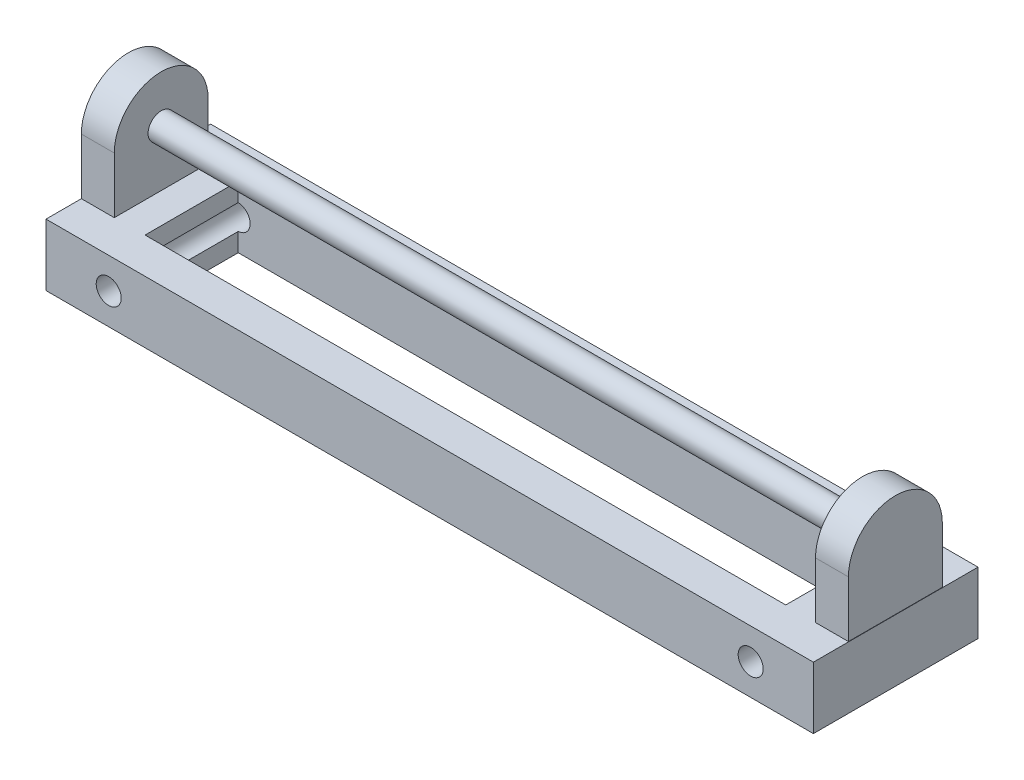
ISO-10303-21;
HEADER;
FILE_DESCRIPTION(('STEP AP214'),'2;1');
FILE_NAME('part.step','',(''),(''),'','','');
FILE_SCHEMA(('AUTOMOTIVE_DESIGN { 1 0 10303 214 1 1 1 1 }'));
ENDSEC;
DATA;
#1=APPLICATION_CONTEXT('core data for automotive mechanical design processes');
#2=APPLICATION_PROTOCOL_DEFINITION('international standard','automotive_design',2000,#1);
#3=PRODUCT_CONTEXT('',#1,'mechanical');
#4=PRODUCT('Part','Part','',(#3));
#5=PRODUCT_RELATED_PRODUCT_CATEGORY('part','',(#4));
#6=PRODUCT_DEFINITION_FORMATION('','',#4);
#7=PRODUCT_DEFINITION_CONTEXT('part definition',#1,'design');
#8=PRODUCT_DEFINITION('design','',#6,#7);
#9=PRODUCT_DEFINITION_SHAPE('','',#8);
#10=(LENGTH_UNIT() NAMED_UNIT(*) SI_UNIT(.MILLI.,.METRE.));
#11=(NAMED_UNIT(*) PLANE_ANGLE_UNIT() SI_UNIT($,.RADIAN.));
#12=(NAMED_UNIT(*) SI_UNIT($,.STERADIAN.) SOLID_ANGLE_UNIT());
#13=UNCERTAINTY_MEASURE_WITH_UNIT(LENGTH_MEASURE(1.E-05),#10,'distance_accuracy_value','');
#14=(GEOMETRIC_REPRESENTATION_CONTEXT(3) GLOBAL_UNCERTAINTY_ASSIGNED_CONTEXT((#13)) GLOBAL_UNIT_ASSIGNED_CONTEXT((#10,
#11,#12)) REPRESENTATION_CONTEXT('',''));
#15=CARTESIAN_POINT('',(0.,0.,0.));
#16=DIRECTION('',(0.,0.,1.));
#17=DIRECTION('',(1.,0.,0.));
#18=AXIS2_PLACEMENT_3D('',#15,#16,#17);
#19=CARTESIAN_POINT('',(0.,-0.612991157302917,50.));
#20=DIRECTION('',(0.,1.,0.));
#21=DIRECTION('',(0.,0.,1.));
#22=AXIS2_PLACEMENT_3D('',#19,#20,#21);
#23=PLANE('',#22);
#24=DIRECTION('',(1.,0.,0.));
#25=VECTOR('',#24,1.);
#26=CARTESIAN_POINT('',(-9.82732681158067,-0.612991157302914,10.8475881355509));
#27=LINE('',#26,#25);
#28=CARTESIAN_POINT('',(-9.82732681158067,-0.612991157302917,10.8475881355509));
#29=VERTEX_POINT('',#28);
#30=CARTESIAN_POINT('',(184.794211893689,-0.6129911573029,10.847588135551));
#31=VERTEX_POINT('',#30);
#32=EDGE_CURVE('E202',#29,#31,#27,.T.);
#33=ORIENTED_EDGE('',*,*,#32,.T.);
#34=DIRECTION('',(0.,0.,1.));
#35=VECTOR('',#34,1.);
#36=CARTESIAN_POINT('',(184.794211893689,-0.612991157302914,39.152411864449));
#37=LINE('',#36,#35);
#38=CARTESIAN_POINT('',(184.794211893689,-0.612991157302914,39.152411864449));
#39=VERTEX_POINT('',#38);
#40=EDGE_CURVE('E229',#31,#39,#37,.T.);
#41=ORIENTED_EDGE('',*,*,#40,.T.);
#42=DIRECTION('',(-1.,0.,0.));
#43=VECTOR('',#42,1.);
#44=CARTESIAN_POINT('',(-9.82732681158069,-0.612991157302914,39.152411864449));
#45=LINE('',#44,#43);
#46=CARTESIAN_POINT('',(-9.82732681158069,-0.612991157302914,39.152411864449));
#47=VERTEX_POINT('',#46);
#48=EDGE_CURVE('E211',#39,#47,#45,.T.);
#49=ORIENTED_EDGE('',*,*,#48,.T.);
#50=DIRECTION('',(0.,0.,-1.));
#51=VECTOR('',#50,1.);
#52=CARTESIAN_POINT('',(-9.82732681158069,-0.612991157302914,39.152411864449));
#53=LINE('',#52,#51);
#54=EDGE_CURVE('E207',#47,#29,#53,.T.);
#55=ORIENTED_EDGE('',*,*,#54,.T.);
#56=EDGE_LOOP('',(#33,#41,#49,#55));
#57=FACE_BOUND('',#56,.T.);
#58=DIRECTION('',(-1.,0.,0.));
#59=VECTOR('',#58,1.);
#60=CARTESIAN_POINT('',(-19.0662585842205,-0.612991157302956,10.7434951065919));
#61=LINE('',#60,#59);
#62=CARTESIAN_POINT('',(-19.0662585842205,-0.612991157302956,10.7434951065919));
#63=VERTEX_POINT('',#62);
#64=CARTESIAN_POINT('',(-29.0662585842205,-0.612991157302956,10.7434951065919));
#65=VERTEX_POINT('',#64);
#66=EDGE_CURVE('E298',#63,#65,#61,.T.);
#67=ORIENTED_EDGE('',*,*,#66,.F.);
#68=DIRECTION('',(0.,0.,1.));
#69=VECTOR('',#68,1.);
#70=CARTESIAN_POINT('',(-19.0662585842205,-0.612991157302952,39.2565048934081));
#71=LINE('',#70,#69);
#72=CARTESIAN_POINT('',(-19.0662585842205,-0.612991157302952,39.2565048934081));
#73=VERTEX_POINT('',#72);
#74=EDGE_CURVE('E279',#63,#73,#71,.T.);
#75=ORIENTED_EDGE('',*,*,#74,.T.);
#76=DIRECTION('',(-1.,0.,0.));
#77=VECTOR('',#76,1.);
#78=CARTESIAN_POINT('',(-19.0662585842205,-0.612991157302952,39.2565048934081));
#79=LINE('',#78,#77);
#80=CARTESIAN_POINT('',(-29.0662585842205,-0.612991157302917,39.2565048934081));
#81=VERTEX_POINT('',#80);
#82=EDGE_CURVE('E292',#73,#81,#79,.T.);
#83=ORIENTED_EDGE('',*,*,#82,.T.);
#84=DIRECTION('',(0.,0.,-1.));
#85=VECTOR('',#84,1.);
#86=CARTESIAN_POINT('',(-29.0662585842205,-0.612991157302917,50.));
#87=LINE('',#86,#85);
#88=CARTESIAN_POINT('',(-29.0662585842205,-0.612991157302917,50.));
#89=VERTEX_POINT('',#88);
#90=EDGE_CURVE('E44',#89,#81,#87,.T.);
#91=ORIENTED_EDGE('',*,*,#90,.F.);
#92=DIRECTION('',(1.,0.,0.));
#93=VECTOR('',#92,1.);
#94=CARTESIAN_POINT('',(0.,-0.612991157302917,50.));
#95=LINE('',#94,#93);
#96=CARTESIAN_POINT('',(204.033143666329,-0.612991157302917,50.));
#97=VERTEX_POINT('',#96);
#98=EDGE_CURVE('E365',#89,#97,#95,.T.);
#99=ORIENTED_EDGE('',*,*,#98,.T.);
#100=DIRECTION('',(0.,0.,-1.));
#101=VECTOR('',#100,1.);
#102=CARTESIAN_POINT('',(204.033143666329,-0.612991157302917,50.));
#103=LINE('',#102,#101);
#104=CARTESIAN_POINT('',(204.033143666329,-0.612991157302917,0.));
#105=VERTEX_POINT('',#104);
#106=EDGE_CURVE('E11',#97,#105,#103,.T.);
#107=ORIENTED_EDGE('',*,*,#106,.T.);
#108=DIRECTION('',(1.,0.,0.));
#109=VECTOR('',#108,1.);
#110=CARTESIAN_POINT('',(0.,-0.612991157302917,0.));
#111=LINE('',#110,#109);
#112=CARTESIAN_POINT('',(-29.0662585842205,-0.612991157302917,0.));
#113=VERTEX_POINT('',#112);
#114=EDGE_CURVE('E329',#113,#105,#111,.T.);
#115=ORIENTED_EDGE('',*,*,#114,.F.);
#116=EDGE_CURVE('E320',#65,#113,#87,.T.);
#117=ORIENTED_EDGE('',*,*,#116,.F.);
#118=EDGE_LOOP('',(#67,#75,#83,#91,#99,#107,#115,#117));
#119=FACE_BOUND('',#118,.T.);
#120=DIRECTION('',(0.,0.,1.));
#121=VECTOR('',#120,1.);
#122=CARTESIAN_POINT('',(203.93374141578,-0.612991157302952,39.2565048934081));
#123=LINE('',#122,#121);
#124=CARTESIAN_POINT('',(203.93374141578,-0.612991157302917,10.7434951065919));
#125=VERTEX_POINT('',#124);
#126=CARTESIAN_POINT('',(203.93374141578,-0.612991157302952,39.2565048934081));
#127=VERTEX_POINT('',#126);
#128=EDGE_CURVE('E247',#125,#127,#123,.T.);
#129=ORIENTED_EDGE('',*,*,#128,.T.);
#130=DIRECTION('',(1.,0.,0.));
#131=VECTOR('',#130,1.);
#132=CARTESIAN_POINT('',(193.93374141578,-0.612991157302952,39.2565048934081));
#133=LINE('',#132,#131);
#134=CARTESIAN_POINT('',(193.93374141578,-0.612991157302952,39.2565048934081));
#135=VERTEX_POINT('',#134);
#136=EDGE_CURVE('E275',#135,#127,#133,.T.);
#137=ORIENTED_EDGE('',*,*,#136,.F.);
#138=DIRECTION('',(0.,0.,1.));
#139=VECTOR('',#138,1.);
#140=CARTESIAN_POINT('',(193.93374141578,-0.612991157302952,39.2565048934081));
#141=LINE('',#140,#139);
#142=CARTESIAN_POINT('',(193.93374141578,-0.612991157302956,10.7434951065919));
#143=VERTEX_POINT('',#142);
#144=EDGE_CURVE('E248',#143,#135,#141,.T.);
#145=ORIENTED_EDGE('',*,*,#144,.F.);
#146=DIRECTION('',(1.,0.,0.));
#147=VECTOR('',#146,1.);
#148=CARTESIAN_POINT('',(193.93374141578,-0.612991157302956,10.7434951065919));
#149=LINE('',#148,#147);
#150=EDGE_CURVE('E258',#143,#125,#149,.T.);
#151=ORIENTED_EDGE('',*,*,#150,.T.);
#152=EDGE_LOOP('',(#129,#137,#145,#151));
#153=FACE_BOUND('',#152,.T.);
#154=ADVANCED_FACE('F35',(#57,#119,#153),#23,.T.);
#155=CARTESIAN_POINT('',(204.033143666329,0.,50.));
#156=DIRECTION('',(1.,0.,0.));
#157=DIRECTION('',(0.,0.,-1.));
#158=AXIS2_PLACEMENT_3D('',#155,#156,#157);
#159=PLANE('',#158);
#160=DIRECTION('',(0.,-1.,0.));
#161=VECTOR('',#160,1.);
#162=CARTESIAN_POINT('',(204.033143666329,0.,0.));
#163=LINE('',#162,#161);
#164=CARTESIAN_POINT('',(204.033143666329,-19.4201237605884,0.));
#165=VERTEX_POINT('',#164);
#166=EDGE_CURVE('E352',#105,#165,#163,.T.);
#167=ORIENTED_EDGE('',*,*,#166,.F.);
#168=ORIENTED_EDGE('',*,*,#106,.F.);
#169=DIRECTION('',(0.,-1.,0.));
#170=VECTOR('',#169,1.);
#171=CARTESIAN_POINT('',(204.033143666329,0.,50.));
#172=LINE('',#171,#170);
#173=CARTESIAN_POINT('',(204.033143666329,-19.4201237605884,50.));
#174=VERTEX_POINT('',#173);
#175=EDGE_CURVE('E367',#97,#174,#172,.T.);
#176=ORIENTED_EDGE('',*,*,#175,.T.);
#177=DIRECTION('',(0.,0.,-1.));
#178=VECTOR('',#177,1.);
#179=CARTESIAN_POINT('',(204.033143666329,-19.4201237605884,50.));
#180=LINE('',#179,#178);
#181=EDGE_CURVE('E335',#174,#165,#180,.T.);
#182=ORIENTED_EDGE('',*,*,#181,.T.);
#183=EDGE_LOOP('',(#167,#168,#176,#182));
#184=FACE_BOUND('',#183,.T.);
#185=ADVANCED_FACE('F401',(#184),#159,.T.);
#186=CARTESIAN_POINT('',(-29.0662585842205,0.,50.));
#187=DIRECTION('',(-1.,0.,0.));
#188=DIRECTION('',(0.,0.,1.));
#189=AXIS2_PLACEMENT_3D('',#186,#187,#188);
#190=PLANE('',#189);
#191=DIRECTION('',(0.,1.,0.));
#192=VECTOR('',#191,1.);
#193=CARTESIAN_POINT('',(-29.0662585842205,0.,0.));
#194=LINE('',#193,#192);
#195=CARTESIAN_POINT('',(-29.0662585842205,-19.4201237605884,0.));
#196=VERTEX_POINT('',#195);
#197=EDGE_CURVE('E349',#196,#113,#194,.T.);
#198=ORIENTED_EDGE('',*,*,#197,.F.);
#199=DIRECTION('',(0.,0.,-1.));
#200=VECTOR('',#199,1.);
#201=CARTESIAN_POINT('',(-29.0662585842205,-19.4201237605884,50.));
#202=LINE('',#201,#200);
#203=CARTESIAN_POINT('',(-29.0662585842205,-19.4201237605884,50.));
#204=VERTEX_POINT('',#203);
#205=EDGE_CURVE('E331',#204,#196,#202,.T.);
#206=ORIENTED_EDGE('',*,*,#205,.F.);
#207=DIRECTION('',(0.,1.,0.));
#208=VECTOR('',#207,1.);
#209=CARTESIAN_POINT('',(-29.0662585842205,0.,50.));
#210=LINE('',#209,#208);
#211=EDGE_CURVE('E362',#204,#89,#210,.T.);
#212=ORIENTED_EDGE('',*,*,#211,.T.);
#213=ORIENTED_EDGE('',*,*,#90,.T.);
#214=DIRECTION('',(0.,1.,0.));
#215=VECTOR('',#214,1.);
#216=CARTESIAN_POINT('',(-29.0662585842205,16.3931982769044,39.2565048934081));
#217=LINE('',#216,#215);
#218=CARTESIAN_POINT('',(-29.0662585842205,16.3931982769044,39.2565048934081));
#219=VERTEX_POINT('',#218);
#220=EDGE_CURVE('E278',#81,#219,#217,.T.);
#221=ORIENTED_EDGE('',*,*,#220,.T.);
#222=CARTESIAN_POINT('',(-29.0662585842205,16.3931982769044,25.));
#223=DIRECTION('',(-1.,0.,0.));
#224=DIRECTION('',(0.,0.,-1.));
#225=AXIS2_PLACEMENT_3D('',#222,#223,#224);
#226=CIRCLE('',#225,14.2565048934081);
#227=CARTESIAN_POINT('',(-29.0662585842205,16.3931982769044,10.7434951065919));
#228=VERTEX_POINT('',#227);
#229=EDGE_CURVE('E293',#219,#228,#226,.T.);
#230=ORIENTED_EDGE('',*,*,#229,.T.);
#231=DIRECTION('',(0.,-1.,0.));
#232=VECTOR('',#231,1.);
#233=CARTESIAN_POINT('',(-29.0662585842205,-0.612991157302956,10.7434951065919));
#234=LINE('',#233,#232);
#235=EDGE_CURVE('E283',#228,#65,#234,.T.);
#236=ORIENTED_EDGE('',*,*,#235,.T.);
#237=ORIENTED_EDGE('',*,*,#116,.T.);
#238=EDGE_LOOP('',(#198,#206,#212,#213,#221,#230,#236,#237));
#239=FACE_BOUND('',#238,.T.);
#240=ADVANCED_FACE('F319',(#239),#190,.T.);
#241=CARTESIAN_POINT('',(0.,-19.4201237605884,50.));
#242=DIRECTION('',(0.,-1.,0.));
#243=DIRECTION('',(0.,0.,-1.));
#244=AXIS2_PLACEMENT_3D('',#241,#242,#243);
#245=PLANE('',#244);
#246=DIRECTION('',(1.,0.,0.));
#247=VECTOR('',#246,1.);
#248=CARTESIAN_POINT('',(-9.82732681158067,-19.4201237605884,10.8475881355509));
#249=LINE('',#248,#247);
#250=CARTESIAN_POINT('',(-9.82732681158067,-19.4201237605884,10.8475881355509));
#251=VERTEX_POINT('',#250);
#252=CARTESIAN_POINT('',(184.794211893689,-19.4201237605884,10.847588135551));
#253=VERTEX_POINT('',#252);
#254=EDGE_CURVE('E192',#251,#253,#249,.T.);
#255=ORIENTED_EDGE('',*,*,#254,.F.);
#256=DIRECTION('',(0.,0.,-1.));
#257=VECTOR('',#256,1.);
#258=CARTESIAN_POINT('',(-9.82732681158069,-19.4201237605884,39.152411864449));
#259=LINE('',#258,#257);
#260=CARTESIAN_POINT('',(-9.82732681158069,-19.4201237605884,39.152411864449));
#261=VERTEX_POINT('',#260);
#262=EDGE_CURVE('E222',#261,#251,#259,.T.);
#263=ORIENTED_EDGE('',*,*,#262,.F.);
#264=DIRECTION('',(-1.,0.,0.));
#265=VECTOR('',#264,1.);
#266=CARTESIAN_POINT('',(-9.82732681158069,-19.4201237605884,39.152411864449));
#267=LINE('',#266,#265);
#268=CARTESIAN_POINT('',(184.794211893689,-19.4201237605884,39.152411864449));
#269=VERTEX_POINT('',#268);
#270=EDGE_CURVE('E60',#269,#261,#267,.T.);
#271=ORIENTED_EDGE('',*,*,#270,.F.);
#272=DIRECTION('',(0.,0.,1.));
#273=VECTOR('',#272,1.);
#274=CARTESIAN_POINT('',(184.794211893689,-19.4201237605884,39.152411864449));
#275=LINE('',#274,#273);
#276=EDGE_CURVE('E219',#253,#269,#275,.T.);
#277=ORIENTED_EDGE('',*,*,#276,.F.);
#278=EDGE_LOOP('',(#255,#263,#271,#277));
#279=FACE_BOUND('',#278,.T.);
#280=DIRECTION('',(-1.,0.,0.));
#281=VECTOR('',#280,1.);
#282=CARTESIAN_POINT('',(0.,-19.4201237605884,0.));
#283=LINE('',#282,#281);
#284=EDGE_CURVE('E346',#165,#196,#283,.T.);
#285=ORIENTED_EDGE('',*,*,#284,.F.);
#286=ORIENTED_EDGE('',*,*,#181,.F.);
#287=DIRECTION('',(-1.,0.,0.));
#288=VECTOR('',#287,1.);
#289=CARTESIAN_POINT('',(0.,-19.4201237605884,50.));
#290=LINE('',#289,#288);
#291=EDGE_CURVE('E359',#174,#204,#290,.T.);
#292=ORIENTED_EDGE('',*,*,#291,.T.);
#293=ORIENTED_EDGE('',*,*,#205,.T.);
#294=EDGE_LOOP('',(#285,#286,#292,#293));
#295=FACE_BOUND('',#294,.T.);
#296=ADVANCED_FACE('F411',(#279,#295),#245,.T.);
#297=CARTESIAN_POINT('',(-10.0165574589457,-10.0165574589457,50.));
#298=DIRECTION('',(0.,0.,-1.));
#299=DIRECTION('',(-1.,0.,0.));
#300=AXIS2_PLACEMENT_3D('',#297,#298,#299);
#301=CYLINDRICAL_SURFACE('',#300,3.79708670005155);
#302=DIRECTION('',(0.,0.,-1.));
#303=VECTOR('',#302,1.);
#304=CARTESIAN_POINT('',(-9.82732681158069,-13.8089260024559,50.));
#305=LINE('',#304,#303);
#306=CARTESIAN_POINT('',(-9.82732681158069,-13.8089260024559,39.152411864449));
#307=VERTEX_POINT('',#306);
#308=CARTESIAN_POINT('',(-9.82732681158067,-13.8089260024559,10.8475881355509));
#309=VERTEX_POINT('',#308);
#310=EDGE_CURVE('E208',#307,#309,#305,.T.);
#311=ORIENTED_EDGE('',*,*,#310,.T.);
#312=CARTESIAN_POINT('',(-10.0165574589457,-10.0165574589457,10.8475881355509));
#313=DIRECTION('',(0.,0.,-1.));
#314=DIRECTION('',(-1.,0.,0.));
#315=AXIS2_PLACEMENT_3D('',#312,#313,#314);
#316=CIRCLE('',#315,3.79708670005155);
#317=CARTESIAN_POINT('',(-9.82732681158067,-6.22418891543541,10.8475881355509));
#318=VERTEX_POINT('',#317);
#319=EDGE_CURVE('E194',#309,#318,#316,.F.);
#320=ORIENTED_EDGE('',*,*,#319,.T.);
#321=DIRECTION('',(0.,0.,-1.));
#322=VECTOR('',#321,1.);
#323=CARTESIAN_POINT('',(-9.82732681158069,-6.22418891543541,50.));
#324=LINE('',#323,#322);
#325=CARTESIAN_POINT('',(-9.82732681158069,-6.22418891543541,39.152411864449));
#326=VERTEX_POINT('',#325);
#327=EDGE_CURVE('E234',#318,#326,#324,.F.);
#328=ORIENTED_EDGE('',*,*,#327,.T.);
#329=CARTESIAN_POINT('',(-10.0165574589457,-10.0165574589457,39.152411864449));
#330=DIRECTION('',(0.,0.,1.));
#331=DIRECTION('',(1.,0.,0.));
#332=AXIS2_PLACEMENT_3D('',#329,#330,#331);
#333=CIRCLE('',#332,3.79708670005155);
#334=EDGE_CURVE('E216',#326,#307,#333,.F.);
#335=ORIENTED_EDGE('',*,*,#334,.T.);
#336=EDGE_LOOP('',(#311,#320,#328,#335));
#337=FACE_BOUND('',#336,.T.);
#338=CARTESIAN_POINT('',(-10.0165574589457,-10.0165574589457,50.));
#339=DIRECTION('',(0.,0.,1.));
#340=DIRECTION('',(1.,0.,0.));
#341=AXIS2_PLACEMENT_3D('',#338,#339,#340);
#342=CIRCLE('',#341,3.79708670005155);
#343=CARTESIAN_POINT('',(-6.21947075889412,-10.0165574589457,50.));
#344=VERTEX_POINT('',#343);
#345=EDGE_CURVE('E303',#344,#344,#342,.T.);
#346=ORIENTED_EDGE('',*,*,#345,.T.);
#347=EDGE_LOOP('',(#346));
#348=FACE_BOUND('',#347,.T.);
#349=CARTESIAN_POINT('',(-10.0165574589457,-10.0165574589457,0.));
#350=DIRECTION('',(0.,0.,1.));
#351=DIRECTION('',(1.,0.,0.));
#352=AXIS2_PLACEMENT_3D('',#349,#350,#351);
#353=CIRCLE('',#352,3.79708670005155);
#354=CARTESIAN_POINT('',(-6.21947075889412,-10.0165574589457,0.));
#355=VERTEX_POINT('',#354);
#356=EDGE_CURVE('E312',#355,#355,#353,.T.);
#357=ORIENTED_EDGE('',*,*,#356,.F.);
#358=EDGE_LOOP('',(#357));
#359=FACE_BOUND('',#358,.T.);
#360=ADVANCED_FACE('F37',(#337,#348,#359),#301,.F.);
#361=CARTESIAN_POINT('',(184.983442541054,-10.0165574589457,50.));
#362=DIRECTION('',(0.,0.,-1.));
#363=DIRECTION('',(-1.,0.,0.));
#364=AXIS2_PLACEMENT_3D('',#361,#362,#363);
#365=CYLINDRICAL_SURFACE('',#364,3.79708670005154);
#366=CARTESIAN_POINT('',(184.983442541054,-10.0165574589457,10.847588135551));
#367=DIRECTION('',(0.,0.,-1.));
#368=DIRECTION('',(-1.,0.,0.));
#369=AXIS2_PLACEMENT_3D('',#366,#367,#368);
#370=CIRCLE('',#369,3.79708670005154);
#371=CARTESIAN_POINT('',(184.794211893689,-6.22418891543541,10.847588135551));
#372=VERTEX_POINT('',#371);
#373=CARTESIAN_POINT('',(184.794211893689,-13.8089260024559,10.847588135551));
#374=VERTEX_POINT('',#373);
#375=EDGE_CURVE('E189',#372,#374,#370,.F.);
#376=ORIENTED_EDGE('',*,*,#375,.T.);
#377=DIRECTION('',(0.,0.,-1.));
#378=VECTOR('',#377,1.);
#379=CARTESIAN_POINT('',(184.794211893689,-13.8089260024559,50.));
#380=LINE('',#379,#378);
#381=CARTESIAN_POINT('',(184.794211893689,-13.8089260024559,39.152411864449));
#382=VERTEX_POINT('',#381);
#383=EDGE_CURVE('E174',#374,#382,#380,.F.);
#384=ORIENTED_EDGE('',*,*,#383,.T.);
#385=CARTESIAN_POINT('',(184.983442541054,-10.0165574589457,39.152411864449));
#386=DIRECTION('',(0.,0.,1.));
#387=DIRECTION('',(1.,0.,0.));
#388=AXIS2_PLACEMENT_3D('',#385,#386,#387);
#389=CIRCLE('',#388,3.79708670005154);
#390=CARTESIAN_POINT('',(184.794211893689,-6.22418891543541,39.152411864449));
#391=VERTEX_POINT('',#390);
#392=EDGE_CURVE('E215',#382,#391,#389,.F.);
#393=ORIENTED_EDGE('',*,*,#392,.T.);
#394=DIRECTION('',(0.,0.,-1.));
#395=VECTOR('',#394,1.);
#396=CARTESIAN_POINT('',(184.794211893689,-6.22418891543541,50.));
#397=LINE('',#396,#395);
#398=EDGE_CURVE('E184',#391,#372,#397,.T.);
#399=ORIENTED_EDGE('',*,*,#398,.T.);
#400=EDGE_LOOP('',(#376,#384,#393,#399));
#401=FACE_BOUND('',#400,.T.);
#402=CARTESIAN_POINT('',(184.983442541054,-10.0165574589457,50.));
#403=DIRECTION('',(0.,0.,1.));
#404=DIRECTION('',(1.,0.,0.));
#405=AXIS2_PLACEMENT_3D('',#402,#403,#404);
#406=CIRCLE('',#405,3.79708670005154);
#407=CARTESIAN_POINT('',(188.780529241106,-10.0165574589457,50.));
#408=VERTEX_POINT('',#407);
#409=EDGE_CURVE('E342',#408,#408,#406,.T.);
#410=ORIENTED_EDGE('',*,*,#409,.T.);
#411=EDGE_LOOP('',(#410));
#412=FACE_BOUND('',#411,.T.);
#413=CARTESIAN_POINT('',(184.983442541054,-10.0165574589457,0.));
#414=DIRECTION('',(0.,0.,1.));
#415=DIRECTION('',(1.,0.,0.));
#416=AXIS2_PLACEMENT_3D('',#413,#414,#415);
#417=CIRCLE('',#416,3.79708670005154);
#418=CARTESIAN_POINT('',(188.780529241106,-10.0165574589457,0.));
#419=VERTEX_POINT('',#418);
#420=EDGE_CURVE('E343',#419,#419,#417,.T.);
#421=ORIENTED_EDGE('',*,*,#420,.F.);
#422=EDGE_LOOP('',(#421));
#423=FACE_BOUND('',#422,.T.);
#424=ADVANCED_FACE('F198',(#401,#412,#423),#365,.F.);
#425=CARTESIAN_POINT('',(0.,0.,50.));
#426=DIRECTION('',(0.,0.,1.));
#427=DIRECTION('',(1.,0.,0.));
#428=AXIS2_PLACEMENT_3D('',#425,#426,#427);
#429=PLANE('',#428);
#430=ORIENTED_EDGE('',*,*,#345,.F.);
#431=EDGE_LOOP('',(#430));
#432=FACE_BOUND('',#431,.T.);
#433=ORIENTED_EDGE('',*,*,#175,.F.);
#434=ORIENTED_EDGE('',*,*,#98,.F.);
#435=ORIENTED_EDGE('',*,*,#211,.F.);
#436=ORIENTED_EDGE('',*,*,#291,.F.);
#437=EDGE_LOOP('',(#433,#434,#435,#436));
#438=FACE_BOUND('',#437,.T.);
#439=ORIENTED_EDGE('',*,*,#409,.F.);
#440=EDGE_LOOP('',(#439));
#441=FACE_BOUND('',#440,.T.);
#442=ADVANCED_FACE('F377',(#432,#438,#441),#429,.T.);
#443=CARTESIAN_POINT('',(0.,0.,0.));
#444=DIRECTION('',(0.,0.,1.));
#445=DIRECTION('',(1.,0.,0.));
#446=AXIS2_PLACEMENT_3D('',#443,#444,#445);
#447=PLANE('',#446);
#448=ORIENTED_EDGE('',*,*,#356,.T.);
#449=EDGE_LOOP('',(#448));
#450=FACE_BOUND('',#449,.T.);
#451=ORIENTED_EDGE('',*,*,#166,.T.);
#452=ORIENTED_EDGE('',*,*,#284,.T.);
#453=ORIENTED_EDGE('',*,*,#197,.T.);
#454=ORIENTED_EDGE('',*,*,#114,.T.);
#455=EDGE_LOOP('',(#451,#452,#453,#454));
#456=FACE_BOUND('',#455,.T.);
#457=ORIENTED_EDGE('',*,*,#420,.T.);
#458=EDGE_LOOP('',(#457));
#459=FACE_BOUND('',#458,.T.);
#460=ADVANCED_FACE('F380',(#450,#456,#459),#447,.F.);
#461=CARTESIAN_POINT('',(-19.0662585842205,-0.612991157302956,10.7434951065919));
#462=DIRECTION('',(0.,0.,-1.));
#463=DIRECTION('',(0.,1.,0.));
#464=AXIS2_PLACEMENT_3D('',#461,#462,#463);
#465=PLANE('',#464);
#466=ORIENTED_EDGE('',*,*,#235,.F.);
#467=DIRECTION('',(-1.,0.,0.));
#468=VECTOR('',#467,1.);
#469=CARTESIAN_POINT('',(-19.0662585842205,16.3931982769044,10.7434951065919));
#470=LINE('',#469,#468);
#471=CARTESIAN_POINT('',(-19.0662585842205,16.3931982769044,10.7434951065919));
#472=VERTEX_POINT('',#471);
#473=EDGE_CURVE('E296',#472,#228,#470,.T.);
#474=ORIENTED_EDGE('',*,*,#473,.F.);
#475=DIRECTION('',(0.,-1.,0.));
#476=VECTOR('',#475,1.);
#477=CARTESIAN_POINT('',(-19.0662585842205,-0.612991157302956,10.7434951065919));
#478=LINE('',#477,#476);
#479=EDGE_CURVE('E289',#472,#63,#478,.T.);
#480=ORIENTED_EDGE('',*,*,#479,.T.);
#481=ORIENTED_EDGE('',*,*,#66,.T.);
#482=EDGE_LOOP('',(#466,#474,#480,#481));
#483=FACE_BOUND('',#482,.T.);
#484=ADVANCED_FACE('F391',(#483),#465,.T.);
#485=CARTESIAN_POINT('',(-19.0662585842205,16.3931982769044,25.));
#486=DIRECTION('',(-1.,0.,0.));
#487=DIRECTION('',(0.,0.,1.));
#488=AXIS2_PLACEMENT_3D('',#485,#486,#487);
#489=CYLINDRICAL_SURFACE('',#488,14.2565048934081);
#490=ORIENTED_EDGE('',*,*,#229,.F.);
#491=DIRECTION('',(-1.,0.,0.));
#492=VECTOR('',#491,1.);
#493=CARTESIAN_POINT('',(-19.0662585842205,16.3931982769044,39.2565048934081));
#494=LINE('',#493,#492);
#495=CARTESIAN_POINT('',(-19.0662585842205,16.3931982769044,39.2565048934081));
#496=VERTEX_POINT('',#495);
#497=EDGE_CURVE('E299',#496,#219,#494,.T.);
#498=ORIENTED_EDGE('',*,*,#497,.F.);
#499=CARTESIAN_POINT('',(-19.0662585842205,16.3931982769044,25.));
#500=DIRECTION('',(-1.,0.,0.));
#501=DIRECTION('',(0.,0.,-1.));
#502=AXIS2_PLACEMENT_3D('',#499,#500,#501);
#503=CIRCLE('',#502,14.2565048934081);
#504=EDGE_CURVE('E286',#496,#472,#503,.T.);
#505=ORIENTED_EDGE('',*,*,#504,.T.);
#506=ORIENTED_EDGE('',*,*,#473,.T.);
#507=EDGE_LOOP('',(#490,#498,#505,#506));
#508=FACE_BOUND('',#507,.T.);
#509=ADVANCED_FACE('F397',(#508),#489,.T.);
#510=CARTESIAN_POINT('',(-19.0662585842205,16.3931982769044,39.2565048934081));
#511=DIRECTION('',(0.,0.,1.));
#512=DIRECTION('',(1.,0.,0.));
#513=AXIS2_PLACEMENT_3D('',#510,#511,#512);
#514=PLANE('',#513);
#515=ORIENTED_EDGE('',*,*,#220,.F.);
#516=ORIENTED_EDGE('',*,*,#82,.F.);
#517=DIRECTION('',(0.,1.,0.));
#518=VECTOR('',#517,1.);
#519=CARTESIAN_POINT('',(-19.0662585842205,16.3931982769044,39.2565048934081));
#520=LINE('',#519,#518);
#521=EDGE_CURVE('E282',#73,#496,#520,.T.);
#522=ORIENTED_EDGE('',*,*,#521,.T.);
#523=ORIENTED_EDGE('',*,*,#497,.T.);
#524=EDGE_LOOP('',(#515,#516,#522,#523));
#525=FACE_BOUND('',#524,.T.);
#526=ADVANCED_FACE('F424',(#525),#514,.T.);
#527=CARTESIAN_POINT('',(-19.0662585842205,16.3931982769044,25.));
#528=DIRECTION('',(1.,0.,0.));
#529=DIRECTION('',(0.,0.,-1.));
#530=AXIS2_PLACEMENT_3D('',#527,#528,#529);
#531=PLANE('',#530);
#532=CARTESIAN_POINT('',(-19.0662585842205,16.3931982769044,25.));
#533=DIRECTION('',(1.,0.,0.));
#534=DIRECTION('',(0.,0.,-1.));
#535=AXIS2_PLACEMENT_3D('',#532,#533,#534);
#536=CIRCLE('',#535,4.00110175958003);
#537=CARTESIAN_POINT('',(-19.0662585842205,16.3931982769044,20.99889824042));
#538=VERTEX_POINT('',#537);
#539=EDGE_CURVE('E237',#538,#538,#536,.T.);
#540=ORIENTED_EDGE('',*,*,#539,.F.);
#541=EDGE_LOOP('',(#540));
#542=FACE_BOUND('',#541,.T.);
#543=ORIENTED_EDGE('',*,*,#74,.F.);
#544=ORIENTED_EDGE('',*,*,#479,.F.);
#545=ORIENTED_EDGE('',*,*,#504,.F.);
#546=ORIENTED_EDGE('',*,*,#521,.F.);
#547=EDGE_LOOP('',(#543,#544,#545,#546));
#548=FACE_BOUND('',#547,.T.);
#549=ADVANCED_FACE('F428',(#542,#548),#531,.T.);
#550=CARTESIAN_POINT('',(193.93374141578,16.3931982769044,25.));
#551=DIRECTION('',(1.,0.,0.));
#552=DIRECTION('',(0.,0.,-1.));
#553=AXIS2_PLACEMENT_3D('',#550,#551,#552);
#554=PLANE('',#553);
#555=ORIENTED_EDGE('',*,*,#144,.T.);
#556=DIRECTION('',(0.,1.,0.));
#557=VECTOR('',#556,1.);
#558=CARTESIAN_POINT('',(193.93374141578,16.3931982769044,39.2565048934081));
#559=LINE('',#558,#557);
#560=CARTESIAN_POINT('',(193.93374141578,16.3931982769044,39.2565048934081));
#561=VERTEX_POINT('',#560);
#562=EDGE_CURVE('E251',#135,#561,#559,.T.);
#563=ORIENTED_EDGE('',*,*,#562,.T.);
#564=CARTESIAN_POINT('',(193.93374141578,16.3931982769044,25.));
#565=DIRECTION('',(-1.,0.,0.));
#566=DIRECTION('',(0.,0.,-1.));
#567=AXIS2_PLACEMENT_3D('',#564,#565,#566);
#568=CIRCLE('',#567,14.2565048934081);
#569=CARTESIAN_POINT('',(193.93374141578,16.3931982769044,10.7434951065919));
#570=VERTEX_POINT('',#569);
#571=EDGE_CURVE('E254',#561,#570,#568,.T.);
#572=ORIENTED_EDGE('',*,*,#571,.T.);
#573=DIRECTION('',(0.,-1.,0.));
#574=VECTOR('',#573,1.);
#575=CARTESIAN_POINT('',(193.93374141578,-0.612991157302956,10.7434951065919));
#576=LINE('',#575,#574);
#577=EDGE_CURVE('E256',#570,#143,#576,.T.);
#578=ORIENTED_EDGE('',*,*,#577,.T.);
#579=EDGE_LOOP('',(#555,#563,#572,#578));
#580=FACE_BOUND('',#579,.T.);
#581=CARTESIAN_POINT('',(193.93374141578,16.3931982769044,25.));
#582=DIRECTION('',(-1.,0.,0.));
#583=DIRECTION('',(0.,0.,1.));
#584=AXIS2_PLACEMENT_3D('',#581,#582,#583);
#585=CIRCLE('',#584,4.00110175958003);
#586=CARTESIAN_POINT('',(193.93374141578,16.3931982769044,29.00110175958));
#587=VERTEX_POINT('',#586);
#588=EDGE_CURVE('E244',#587,#587,#585,.T.);
#589=ORIENTED_EDGE('',*,*,#588,.F.);
#590=EDGE_LOOP('',(#589));
#591=FACE_BOUND('',#590,.T.);
#592=ADVANCED_FACE('F440',(#580,#591),#554,.F.);
#593=CARTESIAN_POINT('',(203.93374141578,16.3931982769044,25.));
#594=DIRECTION('',(1.,0.,0.));
#595=DIRECTION('',(0.,0.,-1.));
#596=AXIS2_PLACEMENT_3D('',#593,#594,#595);
#597=PLANE('',#596);
#598=ORIENTED_EDGE('',*,*,#128,.F.);
#599=DIRECTION('',(0.,-1.,0.));
#600=VECTOR('',#599,1.);
#601=CARTESIAN_POINT('',(203.93374141578,-0.612991157302956,10.7434951065919));
#602=LINE('',#601,#600);
#603=CARTESIAN_POINT('',(203.93374141578,16.3931982769044,10.7434951065919));
#604=VERTEX_POINT('',#603);
#605=EDGE_CURVE('E252',#604,#125,#602,.T.);
#606=ORIENTED_EDGE('',*,*,#605,.F.);
#607=CARTESIAN_POINT('',(203.93374141578,16.3931982769044,25.));
#608=DIRECTION('',(-1.,0.,0.));
#609=DIRECTION('',(0.,0.,-1.));
#610=AXIS2_PLACEMENT_3D('',#607,#608,#609);
#611=CIRCLE('',#610,14.2565048934081);
#612=CARTESIAN_POINT('',(203.93374141578,16.3931982769044,39.2565048934081));
#613=VERTEX_POINT('',#612);
#614=EDGE_CURVE('E263',#613,#604,#611,.T.);
#615=ORIENTED_EDGE('',*,*,#614,.F.);
#616=DIRECTION('',(0.,1.,0.));
#617=VECTOR('',#616,1.);
#618=CARTESIAN_POINT('',(203.93374141578,16.3931982769044,39.2565048934081));
#619=LINE('',#618,#617);
#620=EDGE_CURVE('E261',#127,#613,#619,.T.);
#621=ORIENTED_EDGE('',*,*,#620,.F.);
#622=EDGE_LOOP('',(#598,#606,#615,#621));
#623=FACE_BOUND('',#622,.T.);
#624=ADVANCED_FACE('F446',(#623),#597,.T.);
#625=CARTESIAN_POINT('',(193.93374141578,16.3931982769044,39.2565048934081));
#626=DIRECTION('',(0.,0.,-1.));
#627=DIRECTION('',(-1.,0.,0.));
#628=AXIS2_PLACEMENT_3D('',#625,#626,#627);
#629=PLANE('',#628);
#630=ORIENTED_EDGE('',*,*,#620,.T.);
#631=DIRECTION('',(1.,0.,0.));
#632=VECTOR('',#631,1.);
#633=CARTESIAN_POINT('',(193.93374141578,16.3931982769044,39.2565048934081));
#634=LINE('',#633,#632);
#635=EDGE_CURVE('E272',#561,#613,#634,.T.);
#636=ORIENTED_EDGE('',*,*,#635,.F.);
#637=ORIENTED_EDGE('',*,*,#562,.F.);
#638=ORIENTED_EDGE('',*,*,#136,.T.);
#639=EDGE_LOOP('',(#630,#636,#637,#638));
#640=FACE_BOUND('',#639,.T.);
#641=ADVANCED_FACE('F442',(#640),#629,.F.);
#642=CARTESIAN_POINT('',(193.93374141578,16.3931982769044,25.));
#643=DIRECTION('',(1.,0.,0.));
#644=DIRECTION('',(0.,0.,-1.));
#645=AXIS2_PLACEMENT_3D('',#642,#643,#644);
#646=CYLINDRICAL_SURFACE('',#645,14.2565048934081);
#647=ORIENTED_EDGE('',*,*,#614,.T.);
#648=DIRECTION('',(1.,0.,0.));
#649=VECTOR('',#648,1.);
#650=CARTESIAN_POINT('',(193.93374141578,16.3931982769044,10.7434951065919));
#651=LINE('',#650,#649);
#652=EDGE_CURVE('E269',#570,#604,#651,.T.);
#653=ORIENTED_EDGE('',*,*,#652,.F.);
#654=ORIENTED_EDGE('',*,*,#571,.F.);
#655=ORIENTED_EDGE('',*,*,#635,.T.);
#656=EDGE_LOOP('',(#647,#653,#654,#655));
#657=FACE_BOUND('',#656,.T.);
#658=ADVANCED_FACE('F445',(#657),#646,.T.);
#659=CARTESIAN_POINT('',(193.93374141578,-0.612991157302956,10.7434951065919));
#660=DIRECTION('',(0.,0.,1.));
#661=DIRECTION('',(0.,-1.,0.));
#662=AXIS2_PLACEMENT_3D('',#659,#660,#661);
#663=PLANE('',#662);
#664=ORIENTED_EDGE('',*,*,#605,.T.);
#665=ORIENTED_EDGE('',*,*,#150,.F.);
#666=ORIENTED_EDGE('',*,*,#577,.F.);
#667=ORIENTED_EDGE('',*,*,#652,.T.);
#668=EDGE_LOOP('',(#664,#665,#666,#667));
#669=FACE_BOUND('',#668,.T.);
#670=ADVANCED_FACE('F450',(#669),#663,.F.);
#671=CARTESIAN_POINT('',(-29.0662585842205,16.3931982769044,25.));
#672=DIRECTION('',(1.,0.,0.));
#673=DIRECTION('',(0.,0.,-1.));
#674=AXIS2_PLACEMENT_3D('',#671,#672,#673);
#675=CYLINDRICAL_SURFACE('',#674,4.00110175958003);
#676=ORIENTED_EDGE('',*,*,#539,.T.);
#677=EDGE_LOOP('',(#676));
#678=FACE_BOUND('',#677,.T.);
#679=ORIENTED_EDGE('',*,*,#588,.T.);
#680=EDGE_LOOP('',(#679));
#681=FACE_BOUND('',#680,.T.);
#682=ADVANCED_FACE('F454',(#678,#681),#675,.T.);
#683=CARTESIAN_POINT('',(-9.82732681158067,30.6507031703125,10.8475881355509));
#684=DIRECTION('',(0.,0.,-1.));
#685=DIRECTION('',(-1.,0.,0.));
#686=AXIS2_PLACEMENT_3D('',#683,#684,#685);
#687=PLANE('',#686);
#688=DIRECTION('',(0.,-1.,0.));
#689=VECTOR('',#688,1.);
#690=CARTESIAN_POINT('',(-9.82732681158067,30.6507031703125,10.8475881355509));
#691=LINE('',#690,#689);
#692=EDGE_CURVE('E52',#29,#318,#691,.T.);
#693=ORIENTED_EDGE('',*,*,#692,.T.);
#694=ORIENTED_EDGE('',*,*,#319,.F.);
#695=EDGE_CURVE('E206',#309,#251,#691,.T.);
#696=ORIENTED_EDGE('',*,*,#695,.T.);
#697=ORIENTED_EDGE('',*,*,#254,.T.);
#698=DIRECTION('',(0.,-1.,0.));
#699=VECTOR('',#698,1.);
#700=CARTESIAN_POINT('',(184.794211893689,30.6507031703125,10.847588135551));
#701=LINE('',#700,#699);
#702=EDGE_CURVE('E178',#374,#253,#701,.T.);
#703=ORIENTED_EDGE('',*,*,#702,.F.);
#704=ORIENTED_EDGE('',*,*,#375,.F.);
#705=EDGE_CURVE('E196',#31,#372,#701,.T.);
#706=ORIENTED_EDGE('',*,*,#705,.F.);
#707=ORIENTED_EDGE('',*,*,#32,.F.);
#708=EDGE_LOOP('',(#693,#694,#696,#697,#703,#704,#706,#707));
#709=FACE_BOUND('',#708,.T.);
#710=ADVANCED_FACE('F187',(#709),#687,.F.);
#711=CARTESIAN_POINT('',(184.794211893689,30.6507031703125,39.152411864449));
#712=DIRECTION('',(1.,0.,0.));
#713=DIRECTION('',(0.,0.,-1.));
#714=AXIS2_PLACEMENT_3D('',#711,#712,#713);
#715=PLANE('',#714);
#716=ORIENTED_EDGE('',*,*,#705,.T.);
#717=ORIENTED_EDGE('',*,*,#398,.F.);
#718=DIRECTION('',(0.,-1.,0.));
#719=VECTOR('',#718,1.);
#720=CARTESIAN_POINT('',(184.794211893689,30.6507031703125,39.152411864449));
#721=LINE('',#720,#719);
#722=EDGE_CURVE('E212',#39,#391,#721,.T.);
#723=ORIENTED_EDGE('',*,*,#722,.F.);
#724=ORIENTED_EDGE('',*,*,#40,.F.);
#725=EDGE_LOOP('',(#716,#717,#723,#724));
#726=FACE_BOUND('',#725,.T.);
#727=ADVANCED_FACE('F469',(#726),#715,.F.);
#728=ORIENTED_EDGE('',*,*,#702,.T.);
#729=ORIENTED_EDGE('',*,*,#276,.T.);
#730=EDGE_CURVE('E180',#382,#269,#721,.T.);
#731=ORIENTED_EDGE('',*,*,#730,.F.);
#732=ORIENTED_EDGE('',*,*,#383,.F.);
#733=EDGE_LOOP('',(#728,#729,#731,#732));
#734=FACE_BOUND('',#733,.T.);
#735=ADVANCED_FACE('F176',(#734),#715,.F.);
#736=CARTESIAN_POINT('',(-9.82732681158069,30.6507031703125,39.152411864449));
#737=DIRECTION('',(0.,0.,1.));
#738=DIRECTION('',(1.,0.,0.));
#739=AXIS2_PLACEMENT_3D('',#736,#737,#738);
#740=PLANE('',#739);
#741=ORIENTED_EDGE('',*,*,#722,.T.);
#742=ORIENTED_EDGE('',*,*,#392,.F.);
#743=ORIENTED_EDGE('',*,*,#730,.T.);
#744=ORIENTED_EDGE('',*,*,#270,.T.);
#745=DIRECTION('',(0.,-1.,0.));
#746=VECTOR('',#745,1.);
#747=CARTESIAN_POINT('',(-9.82732681158069,30.6507031703125,39.152411864449));
#748=LINE('',#747,#746);
#749=EDGE_CURVE('E213',#307,#261,#748,.T.);
#750=ORIENTED_EDGE('',*,*,#749,.F.);
#751=ORIENTED_EDGE('',*,*,#334,.F.);
#752=EDGE_CURVE('E217',#47,#326,#748,.T.);
#753=ORIENTED_EDGE('',*,*,#752,.F.);
#754=ORIENTED_EDGE('',*,*,#48,.F.);
#755=EDGE_LOOP('',(#741,#742,#743,#744,#750,#751,#753,#754));
#756=FACE_BOUND('',#755,.T.);
#757=ADVANCED_FACE('F473',(#756),#740,.F.);
#758=CARTESIAN_POINT('',(-9.82732681158069,30.6507031703125,39.152411864449));
#759=DIRECTION('',(-1.,0.,0.));
#760=DIRECTION('',(0.,0.,1.));
#761=AXIS2_PLACEMENT_3D('',#758,#759,#760);
#762=PLANE('',#761);
#763=ORIENTED_EDGE('',*,*,#749,.T.);
#764=ORIENTED_EDGE('',*,*,#262,.T.);
#765=ORIENTED_EDGE('',*,*,#695,.F.);
#766=ORIENTED_EDGE('',*,*,#310,.F.);
#767=EDGE_LOOP('',(#763,#764,#765,#766));
#768=FACE_BOUND('',#767,.T.);
#769=ADVANCED_FACE('F468',(#768),#762,.F.);
#770=ORIENTED_EDGE('',*,*,#752,.T.);
#771=ORIENTED_EDGE('',*,*,#327,.F.);
#772=ORIENTED_EDGE('',*,*,#692,.F.);
#773=ORIENTED_EDGE('',*,*,#54,.F.);
#774=EDGE_LOOP('',(#770,#771,#772,#773));
#775=FACE_BOUND('',#774,.T.);
#776=ADVANCED_FACE('F465',(#775),#762,.F.);
#777=CLOSED_SHELL('',(#154,#185,#240,#296,#360,#424,#442,#460,#484,#509,#526,#549,#592,#624,
#641,#658,#670,#682,#710,#727,#735,#757,#769,#776));
#778=MANIFOLD_SOLID_BREP('B2',#777);
#779=ADVANCED_BREP_SHAPE_REPRESENTATION('',(#18,#778),#14);
#780=SHAPE_DEFINITION_REPRESENTATION(#9,#779);
ENDSEC;
END-ISO-10303-21;
